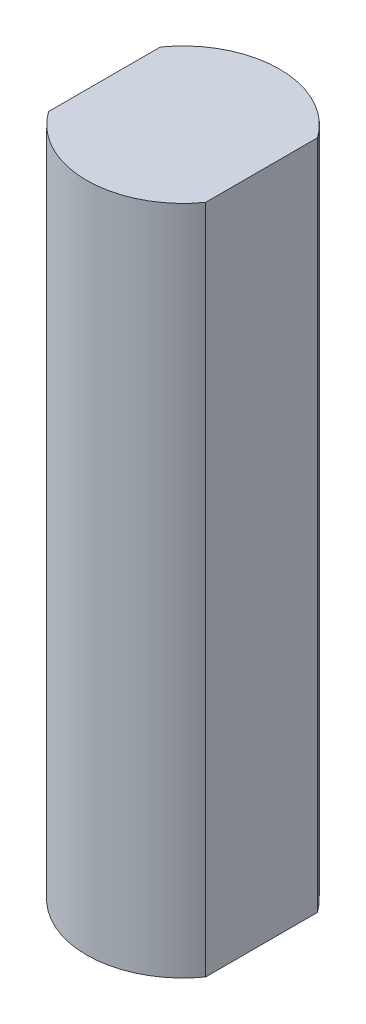
ISO-10303-21;
HEADER;
FILE_DESCRIPTION(('STEP AP214'),'2;1');
FILE_NAME('part.step','',(''),(''),'','','');
FILE_SCHEMA(('AUTOMOTIVE_DESIGN { 1 0 10303 214 1 1 1 1 }'));
ENDSEC;
DATA;
#1=APPLICATION_CONTEXT('core data for automotive mechanical design processes');
#2=APPLICATION_PROTOCOL_DEFINITION('international standard','automotive_design',2000,#1);
#3=PRODUCT_CONTEXT('',#1,'mechanical');
#4=PRODUCT('Part','Part','',(#3));
#5=PRODUCT_RELATED_PRODUCT_CATEGORY('part','',(#4));
#6=PRODUCT_DEFINITION_FORMATION('','',#4);
#7=PRODUCT_DEFINITION_CONTEXT('part definition',#1,'design');
#8=PRODUCT_DEFINITION('design','',#6,#7);
#9=PRODUCT_DEFINITION_SHAPE('','',#8);
#10=(LENGTH_UNIT() NAMED_UNIT(*) SI_UNIT(.MILLI.,.METRE.));
#11=(NAMED_UNIT(*) PLANE_ANGLE_UNIT() SI_UNIT($,.RADIAN.));
#12=(NAMED_UNIT(*) SI_UNIT($,.STERADIAN.) SOLID_ANGLE_UNIT());
#13=UNCERTAINTY_MEASURE_WITH_UNIT(LENGTH_MEASURE(1.E-05),#10,'distance_accuracy_value','');
#14=(GEOMETRIC_REPRESENTATION_CONTEXT(3) GLOBAL_UNCERTAINTY_ASSIGNED_CONTEXT((#13)) GLOBAL_UNIT_ASSIGNED_CONTEXT((#10,
#11,#12)) REPRESENTATION_CONTEXT('',''));
#15=CARTESIAN_POINT('',(0.,0.,0.));
#16=DIRECTION('',(0.,0.,1.));
#17=DIRECTION('',(1.,0.,0.));
#18=AXIS2_PLACEMENT_3D('',#15,#16,#17);
#19=CARTESIAN_POINT('',(0.,30.48,0.));
#20=DIRECTION('',(0.,-1.,0.));
#21=DIRECTION('',(0.,0.,-1.));
#22=AXIS2_PLACEMENT_3D('',#19,#20,#21);
#23=CYLINDRICAL_SURFACE('',#22,4.3815);
#24=DIRECTION('',(0.,1.,0.));
#25=VECTOR('',#24,1.);
#26=CARTESIAN_POINT('',(-3.57014597040513,-17.78,-2.54));
#27=LINE('',#26,#25);
#28=CARTESIAN_POINT('',(-3.57014597040513,0.,-2.54));
#29=VERTEX_POINT('',#28);
#30=CARTESIAN_POINT('',(-3.57014597040513,30.48,-2.54));
#31=VERTEX_POINT('',#30);
#32=EDGE_CURVE('E48',#29,#31,#27,.T.);
#33=ORIENTED_EDGE('',*,*,#32,.T.);
#34=CARTESIAN_POINT('',(0.,30.48,0.));
#35=DIRECTION('',(0.,1.,0.));
#36=DIRECTION('',(0.,0.,1.));
#37=AXIS2_PLACEMENT_3D('',#34,#35,#36);
#38=CIRCLE('',#37,4.3815);
#39=CARTESIAN_POINT('',(3.57014597040513,30.48,-2.54));
#40=VERTEX_POINT('',#39);
#41=EDGE_CURVE('E85',#40,#31,#38,.T.);
#42=ORIENTED_EDGE('',*,*,#41,.F.);
#43=DIRECTION('',(0.,1.,0.));
#44=VECTOR('',#43,1.);
#45=CARTESIAN_POINT('',(3.57014597040513,-17.78,-2.54));
#46=LINE('',#45,#44);
#47=CARTESIAN_POINT('',(3.57014597040513,0.,-2.54));
#48=VERTEX_POINT('',#47);
#49=EDGE_CURVE('E96',#48,#40,#46,.T.);
#50=ORIENTED_EDGE('',*,*,#49,.F.);
#51=CARTESIAN_POINT('',(0.,0.,0.));
#52=DIRECTION('',(0.,1.,0.));
#53=DIRECTION('',(0.,0.,1.));
#54=AXIS2_PLACEMENT_3D('',#51,#52,#53);
#55=CIRCLE('',#54,4.3815);
#56=EDGE_CURVE('E87',#48,#29,#55,.T.);
#57=ORIENTED_EDGE('',*,*,#56,.T.);
#58=EDGE_LOOP('',(#33,#42,#50,#57));
#59=FACE_BOUND('',#58,.T.);
#60=ADVANCED_FACE('F35',(#59),#23,.T.);
#61=DIRECTION('',(0.,1.,0.));
#62=VECTOR('',#61,1.);
#63=CARTESIAN_POINT('',(-3.57014597040513,-17.78,2.54));
#64=LINE('',#63,#62);
#65=CARTESIAN_POINT('',(-3.57014597040513,0.,2.54));
#66=VERTEX_POINT('',#65);
#67=CARTESIAN_POINT('',(-3.57014597040513,30.48,2.54));
#68=VERTEX_POINT('',#67);
#69=EDGE_CURVE('E75',#66,#68,#64,.T.);
#70=ORIENTED_EDGE('',*,*,#69,.F.);
#71=CARTESIAN_POINT('',(3.57014597040513,0.,2.54));
#72=VERTEX_POINT('',#71);
#73=EDGE_CURVE('E98',#66,#72,#55,.T.);
#74=ORIENTED_EDGE('',*,*,#73,.T.);
#75=DIRECTION('',(0.,1.,0.));
#76=VECTOR('',#75,1.);
#77=CARTESIAN_POINT('',(3.57014597040513,-17.78,2.54));
#78=LINE('',#77,#76);
#79=CARTESIAN_POINT('',(3.57014597040513,30.48,2.54));
#80=VERTEX_POINT('',#79);
#81=EDGE_CURVE('E56',#72,#80,#78,.T.);
#82=ORIENTED_EDGE('',*,*,#81,.T.);
#83=EDGE_CURVE('E92',#68,#80,#38,.T.);
#84=ORIENTED_EDGE('',*,*,#83,.F.);
#85=EDGE_LOOP('',(#70,#74,#82,#84));
#86=FACE_BOUND('',#85,.T.);
#87=ADVANCED_FACE('F107',(#86),#23,.T.);
#88=CARTESIAN_POINT('',(0.,30.48,0.));
#89=DIRECTION('',(0.,1.,0.));
#90=DIRECTION('',(0.,0.,1.));
#91=AXIS2_PLACEMENT_3D('',#88,#89,#90);
#92=PLANE('',#91);
#93=ORIENTED_EDGE('',*,*,#41,.T.);
#94=DIRECTION('',(0.,0.,1.));
#95=VECTOR('',#94,1.);
#96=CARTESIAN_POINT('',(-3.57014597040513,30.48,0.));
#97=LINE('',#96,#95);
#98=EDGE_CURVE('E72',#31,#68,#97,.T.);
#99=ORIENTED_EDGE('',*,*,#98,.T.);
#100=ORIENTED_EDGE('',*,*,#83,.T.);
#101=DIRECTION('',(0.,0.,1.));
#102=VECTOR('',#101,1.);
#103=CARTESIAN_POINT('',(3.57014597040513,30.48,0.));
#104=LINE('',#103,#102);
#105=EDGE_CURVE('E91',#40,#80,#104,.T.);
#106=ORIENTED_EDGE('',*,*,#105,.F.);
#107=EDGE_LOOP('',(#93,#99,#100,#106));
#108=FACE_BOUND('',#107,.T.);
#109=ADVANCED_FACE('F90',(#108),#92,.T.);
#110=CARTESIAN_POINT('',(0.,0.,0.));
#111=DIRECTION('',(0.,1.,0.));
#112=DIRECTION('',(0.,0.,1.));
#113=AXIS2_PLACEMENT_3D('',#110,#111,#112);
#114=PLANE('',#113);
#115=DIRECTION('',(0.,0.,1.));
#116=VECTOR('',#115,1.);
#117=CARTESIAN_POINT('',(-3.57014597040513,0.,0.));
#118=LINE('',#117,#116);
#119=EDGE_CURVE('E11',#29,#66,#118,.T.);
#120=ORIENTED_EDGE('',*,*,#119,.F.);
#121=ORIENTED_EDGE('',*,*,#56,.F.);
#122=DIRECTION('',(0.,0.,1.));
#123=VECTOR('',#122,1.);
#124=CARTESIAN_POINT('',(3.57014597040513,0.,0.));
#125=LINE('',#124,#123);
#126=EDGE_CURVE('E42',#48,#72,#125,.T.);
#127=ORIENTED_EDGE('',*,*,#126,.T.);
#128=ORIENTED_EDGE('',*,*,#73,.F.);
#129=EDGE_LOOP('',(#120,#121,#127,#128));
#130=FACE_BOUND('',#129,.T.);
#131=ADVANCED_FACE('F106',(#130),#114,.F.);
#132=CARTESIAN_POINT('',(3.57014597040513,-17.78,0.));
#133=DIRECTION('',(-1.,0.,0.));
#134=DIRECTION('',(0.,0.,1.));
#135=AXIS2_PLACEMENT_3D('',#132,#133,#134);
#136=PLANE('',#135);
#137=ORIENTED_EDGE('',*,*,#49,.T.);
#138=ORIENTED_EDGE('',*,*,#105,.T.);
#139=ORIENTED_EDGE('',*,*,#81,.F.);
#140=ORIENTED_EDGE('',*,*,#126,.F.);
#141=EDGE_LOOP('',(#137,#138,#139,#140));
#142=FACE_BOUND('',#141,.T.);
#143=ADVANCED_FACE('F104',(#142),#136,.F.);
#144=CARTESIAN_POINT('',(-3.57014597040513,-17.78,0.));
#145=DIRECTION('',(-1.,0.,0.));
#146=DIRECTION('',(0.,0.,1.));
#147=AXIS2_PLACEMENT_3D('',#144,#145,#146);
#148=PLANE('',#147);
#149=ORIENTED_EDGE('',*,*,#119,.T.);
#150=ORIENTED_EDGE('',*,*,#69,.T.);
#151=ORIENTED_EDGE('',*,*,#98,.F.);
#152=ORIENTED_EDGE('',*,*,#32,.F.);
#153=EDGE_LOOP('',(#149,#150,#151,#152));
#154=FACE_BOUND('',#153,.T.);
#155=ADVANCED_FACE('F73',(#154),#148,.T.);
#156=CLOSED_SHELL('',(#60,#87,#109,#131,#143,#155));
#157=MANIFOLD_SOLID_BREP('B2',#156);
#158=ADVANCED_BREP_SHAPE_REPRESENTATION('',(#18,#157),#14);
#159=SHAPE_DEFINITION_REPRESENTATION(#9,#158);
ENDSEC;
END-ISO-10303-21;
